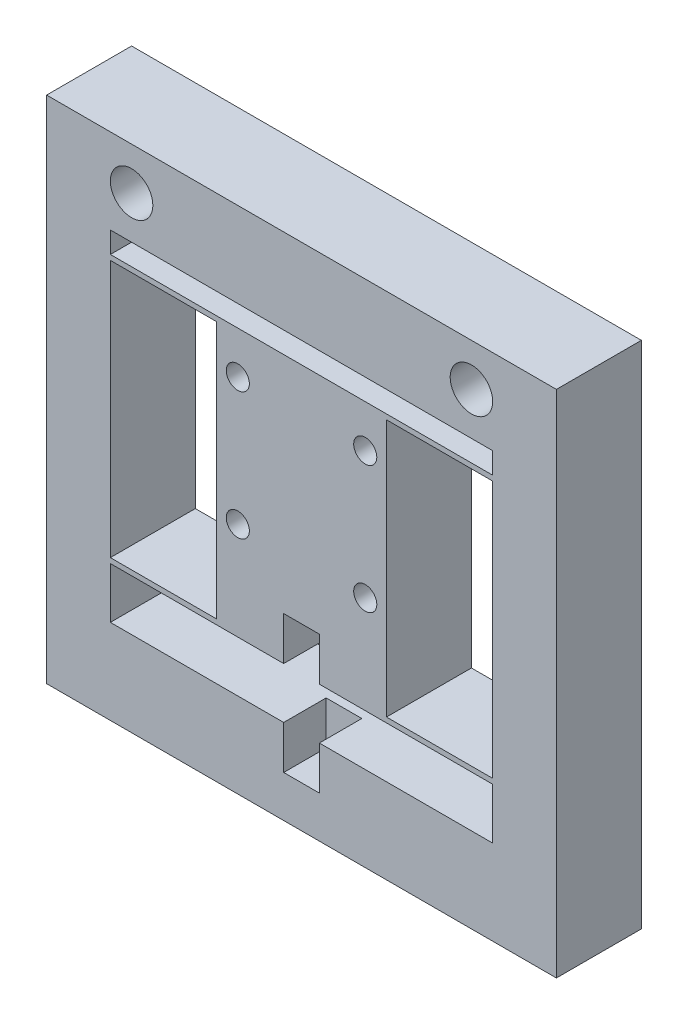
ISO-10303-21;
HEADER;
FILE_DESCRIPTION(('STEP AP214'),'2;1');
FILE_NAME('part.step','',(''),(''),'','','');
FILE_SCHEMA(('AUTOMOTIVE_DESIGN { 1 0 10303 214 1 1 1 1 }'));
ENDSEC;
DATA;
#1=APPLICATION_CONTEXT('core data for automotive mechanical design processes');
#2=APPLICATION_PROTOCOL_DEFINITION('international standard','automotive_design',2000,#1);
#3=PRODUCT_CONTEXT('',#1,'mechanical');
#4=PRODUCT('Part','Part','',(#3));
#5=PRODUCT_RELATED_PRODUCT_CATEGORY('part','',(#4));
#6=PRODUCT_DEFINITION_FORMATION('','',#4);
#7=PRODUCT_DEFINITION_CONTEXT('part definition',#1,'design');
#8=PRODUCT_DEFINITION('design','',#6,#7);
#9=PRODUCT_DEFINITION_SHAPE('','',#8);
#10=(LENGTH_UNIT() NAMED_UNIT(*) SI_UNIT(.MILLI.,.METRE.));
#11=(NAMED_UNIT(*) PLANE_ANGLE_UNIT() SI_UNIT($,.RADIAN.));
#12=(NAMED_UNIT(*) SI_UNIT($,.STERADIAN.) SOLID_ANGLE_UNIT());
#13=UNCERTAINTY_MEASURE_WITH_UNIT(LENGTH_MEASURE(1.E-05),#10,'distance_accuracy_value','');
#14=(GEOMETRIC_REPRESENTATION_CONTEXT(3) GLOBAL_UNCERTAINTY_ASSIGNED_CONTEXT((#13)) GLOBAL_UNIT_ASSIGNED_CONTEXT((#10,
#11,#12)) REPRESENTATION_CONTEXT('',''));
#15=CARTESIAN_POINT('',(0.,0.,0.));
#16=DIRECTION('',(0.,0.,1.));
#17=DIRECTION('',(1.,0.,0.));
#18=AXIS2_PLACEMENT_3D('',#15,#16,#17);
#19=CARTESIAN_POINT('',(-38.1,38.1,6.35));
#20=DIRECTION('',(1.,0.,0.));
#21=DIRECTION('',(0.,1.,0.));
#22=AXIS2_PLACEMENT_3D('',#19,#20,#21);
#23=PLANE('',#22);
#24=DIRECTION('',(0.,-1.,0.));
#25=VECTOR('',#24,1.);
#26=CARTESIAN_POINT('',(-38.1,38.1,-6.35));
#27=LINE('',#26,#25);
#28=CARTESIAN_POINT('',(-38.1,38.1,-6.35));
#29=VERTEX_POINT('',#28);
#30=CARTESIAN_POINT('',(-38.1,-38.1,-6.35));
#31=VERTEX_POINT('',#30);
#32=EDGE_CURVE('E395',#29,#31,#27,.T.);
#33=ORIENTED_EDGE('',*,*,#32,.T.);
#34=DIRECTION('',(0.,0.,-1.));
#35=VECTOR('',#34,1.);
#36=CARTESIAN_POINT('',(-38.1,-38.1,6.35));
#37=LINE('',#36,#35);
#38=CARTESIAN_POINT('',(-38.1,-38.1,6.35));
#39=VERTEX_POINT('',#38);
#40=EDGE_CURVE('E428',#39,#31,#37,.T.);
#41=ORIENTED_EDGE('',*,*,#40,.F.);
#42=DIRECTION('',(0.,-1.,0.));
#43=VECTOR('',#42,1.);
#44=CARTESIAN_POINT('',(-38.1,38.1,6.35));
#45=LINE('',#44,#43);
#46=CARTESIAN_POINT('',(-38.1,38.1,6.35));
#47=VERTEX_POINT('',#46);
#48=EDGE_CURVE('E402',#47,#39,#45,.T.);
#49=ORIENTED_EDGE('',*,*,#48,.F.);
#50=DIRECTION('',(0.,0.,-1.));
#51=VECTOR('',#50,1.);
#52=CARTESIAN_POINT('',(-38.1,38.1,6.35));
#53=LINE('',#52,#51);
#54=EDGE_CURVE('E412',#47,#29,#53,.T.);
#55=ORIENTED_EDGE('',*,*,#54,.T.);
#56=EDGE_LOOP('',(#33,#41,#49,#55));
#57=FACE_BOUND('',#56,.T.);
#58=ADVANCED_FACE('F34',(#57),#23,.F.);
#59=CARTESIAN_POINT('',(-38.1,-38.1,6.35));
#60=DIRECTION('',(0.,1.,0.));
#61=DIRECTION('',(0.,0.,1.));
#62=AXIS2_PLACEMENT_3D('',#59,#60,#61);
#63=PLANE('',#62);
#64=DIRECTION('',(1.,0.,0.));
#65=VECTOR('',#64,1.);
#66=CARTESIAN_POINT('',(-38.1,-38.1,-6.35));
#67=LINE('',#66,#65);
#68=CARTESIAN_POINT('',(38.1,-38.1,-6.35));
#69=VERTEX_POINT('',#68);
#70=EDGE_CURVE('E415',#31,#69,#67,.T.);
#71=ORIENTED_EDGE('',*,*,#70,.T.);
#72=DIRECTION('',(0.,0.,-1.));
#73=VECTOR('',#72,1.);
#74=CARTESIAN_POINT('',(38.1,-38.1,6.35));
#75=LINE('',#74,#73);
#76=CARTESIAN_POINT('',(38.1,-38.1,6.35));
#77=VERTEX_POINT('',#76);
#78=EDGE_CURVE('E425',#77,#69,#75,.T.);
#79=ORIENTED_EDGE('',*,*,#78,.F.);
#80=DIRECTION('',(1.,0.,0.));
#81=VECTOR('',#80,1.);
#82=CARTESIAN_POINT('',(-38.1,-38.1,6.35));
#83=LINE('',#82,#81);
#84=EDGE_CURVE('E405',#39,#77,#83,.T.);
#85=ORIENTED_EDGE('',*,*,#84,.F.);
#86=ORIENTED_EDGE('',*,*,#40,.T.);
#87=EDGE_LOOP('',(#71,#79,#85,#86));
#88=FACE_BOUND('',#87,.T.);
#89=ADVANCED_FACE('F531',(#88),#63,.F.);
#90=CARTESIAN_POINT('',(38.1,38.1,6.35));
#91=DIRECTION('',(-1.,0.,0.));
#92=DIRECTION('',(0.,-1.,0.));
#93=AXIS2_PLACEMENT_3D('',#90,#91,#92);
#94=PLANE('',#93);
#95=DIRECTION('',(0.,1.,0.));
#96=VECTOR('',#95,1.);
#97=CARTESIAN_POINT('',(38.1,38.1,-6.35));
#98=LINE('',#97,#96);
#99=CARTESIAN_POINT('',(38.1,38.1,-6.35));
#100=VERTEX_POINT('',#99);
#101=EDGE_CURVE('E417',#69,#100,#98,.T.);
#102=ORIENTED_EDGE('',*,*,#101,.T.);
#103=DIRECTION('',(0.,0.,-1.));
#104=VECTOR('',#103,1.);
#105=CARTESIAN_POINT('',(38.1,38.1,6.35));
#106=LINE('',#105,#104);
#107=CARTESIAN_POINT('',(38.1,38.1,6.35));
#108=VERTEX_POINT('',#107);
#109=EDGE_CURVE('E422',#108,#100,#106,.T.);
#110=ORIENTED_EDGE('',*,*,#109,.F.);
#111=DIRECTION('',(0.,1.,0.));
#112=VECTOR('',#111,1.);
#113=CARTESIAN_POINT('',(38.1,38.1,6.35));
#114=LINE('',#113,#112);
#115=EDGE_CURVE('E408',#77,#108,#114,.T.);
#116=ORIENTED_EDGE('',*,*,#115,.F.);
#117=ORIENTED_EDGE('',*,*,#78,.T.);
#118=EDGE_LOOP('',(#102,#110,#116,#117));
#119=FACE_BOUND('',#118,.T.);
#120=ADVANCED_FACE('F536',(#119),#94,.F.);
#121=CARTESIAN_POINT('',(-38.1,38.1,6.35));
#122=DIRECTION('',(0.,-1.,0.));
#123=DIRECTION('',(0.,0.,-1.));
#124=AXIS2_PLACEMENT_3D('',#121,#122,#123);
#125=PLANE('',#124);
#126=DIRECTION('',(-1.,0.,0.));
#127=VECTOR('',#126,1.);
#128=CARTESIAN_POINT('',(-38.1,38.1,-6.35));
#129=LINE('',#128,#127);
#130=EDGE_CURVE('E406',#100,#29,#129,.T.);
#131=ORIENTED_EDGE('',*,*,#130,.T.);
#132=ORIENTED_EDGE('',*,*,#54,.F.);
#133=DIRECTION('',(-1.,0.,0.));
#134=VECTOR('',#133,1.);
#135=CARTESIAN_POINT('',(-38.1,38.1,6.35));
#136=LINE('',#135,#134);
#137=EDGE_CURVE('E410',#108,#47,#136,.T.);
#138=ORIENTED_EDGE('',*,*,#137,.F.);
#139=ORIENTED_EDGE('',*,*,#109,.T.);
#140=EDGE_LOOP('',(#131,#132,#138,#139));
#141=FACE_BOUND('',#140,.T.);
#142=ADVANCED_FACE('F501',(#141),#125,.F.);
#143=CARTESIAN_POINT('',(0.,0.,6.35));
#144=DIRECTION('',(0.,0.,1.));
#145=DIRECTION('',(1.,0.,0.));
#146=AXIS2_PLACEMENT_3D('',#143,#144,#145);
#147=PLANE('',#146);
#148=CARTESIAN_POINT('',(-9.525,15.875,6.35));
#149=DIRECTION('',(0.,0.,1.));
#150=DIRECTION('',(1.,0.,0.));
#151=AXIS2_PLACEMENT_3D('',#148,#149,#150);
#152=CIRCLE('',#151,1.72719999999999);
#153=CARTESIAN_POINT('',(-7.79780000000001,15.875,6.35));
#154=VERTEX_POINT('',#153);
#155=EDGE_CURVE('E493',#154,#154,#152,.T.);
#156=ORIENTED_EDGE('',*,*,#155,.F.);
#157=EDGE_LOOP('',(#156));
#158=FACE_BOUND('',#157,.T.);
#159=CARTESIAN_POINT('',(9.525,15.875,6.35));
#160=DIRECTION('',(0.,0.,1.));
#161=DIRECTION('',(1.,0.,0.));
#162=AXIS2_PLACEMENT_3D('',#159,#160,#161);
#163=CIRCLE('',#162,1.72719999999999);
#164=CARTESIAN_POINT('',(11.2522,15.875,6.35));
#165=VERTEX_POINT('',#164);
#166=EDGE_CURVE('E487',#165,#165,#163,.T.);
#167=ORIENTED_EDGE('',*,*,#166,.F.);
#168=EDGE_LOOP('',(#167));
#169=FACE_BOUND('',#168,.T.);
#170=CARTESIAN_POINT('',(9.525,-3.175,6.35));
#171=DIRECTION('',(0.,0.,1.));
#172=DIRECTION('',(1.,0.,0.));
#173=AXIS2_PLACEMENT_3D('',#170,#171,#172);
#174=CIRCLE('',#173,1.72719999999999);
#175=CARTESIAN_POINT('',(11.2522,-3.175,6.35));
#176=VERTEX_POINT('',#175);
#177=EDGE_CURVE('E481',#176,#176,#174,.T.);
#178=ORIENTED_EDGE('',*,*,#177,.F.);
#179=EDGE_LOOP('',(#178));
#180=FACE_BOUND('',#179,.T.);
#181=CARTESIAN_POINT('',(-9.525,-3.175,6.35));
#182=DIRECTION('',(0.,0.,1.));
#183=DIRECTION('',(1.,0.,0.));
#184=AXIS2_PLACEMENT_3D('',#181,#182,#183);
#185=CIRCLE('',#184,1.72719999999999);
#186=CARTESIAN_POINT('',(-7.79780000000001,-3.175,6.35));
#187=VERTEX_POINT('',#186);
#188=EDGE_CURVE('E475',#187,#187,#185,.T.);
#189=ORIENTED_EDGE('',*,*,#188,.F.);
#190=EDGE_LOOP('',(#189));
#191=FACE_BOUND('',#190,.T.);
#192=CARTESIAN_POINT('',(-25.4,31.75,6.35));
#193=DIRECTION('',(0.,0.,1.));
#194=DIRECTION('',(1.,0.,0.));
#195=AXIS2_PLACEMENT_3D('',#192,#193,#194);
#196=CIRCLE('',#195,3.17499999999999);
#197=CARTESIAN_POINT('',(-22.225,31.75,6.35));
#198=VERTEX_POINT('',#197);
#199=EDGE_CURVE('E469',#198,#198,#196,.T.);
#200=ORIENTED_EDGE('',*,*,#199,.F.);
#201=EDGE_LOOP('',(#200));
#202=FACE_BOUND('',#201,.T.);
#203=CARTESIAN_POINT('',(25.4,31.75,6.35));
#204=DIRECTION('',(0.,0.,1.));
#205=DIRECTION('',(1.,0.,0.));
#206=AXIS2_PLACEMENT_3D('',#203,#204,#205);
#207=CIRCLE('',#206,3.17499999999999);
#208=CARTESIAN_POINT('',(28.575,31.75,6.35));
#209=VERTEX_POINT('',#208);
#210=EDGE_CURVE('E460',#209,#209,#207,.T.);
#211=ORIENTED_EDGE('',*,*,#210,.F.);
#212=EDGE_LOOP('',(#211));
#213=FACE_BOUND('',#212,.T.);
#214=DIRECTION('',(0.,-1.,0.));
#215=VECTOR('',#214,1.);
#216=CARTESIAN_POINT('',(-2.667,-11.303,6.35));
#217=LINE('',#216,#215);
#218=CARTESIAN_POINT('',(-2.667,-11.303,6.35));
#219=VERTEX_POINT('',#218);
#220=CARTESIAN_POINT('',(-2.667,-17.78,6.35));
#221=VERTEX_POINT('',#220);
#222=EDGE_CURVE('E246',#219,#221,#217,.T.);
#223=ORIENTED_EDGE('',*,*,#222,.F.);
#224=DIRECTION('',(-1.,0.,0.));
#225=VECTOR('',#224,1.);
#226=CARTESIAN_POINT('',(-2.667,-11.303,6.35));
#227=LINE('',#226,#225);
#228=CARTESIAN_POINT('',(2.667,-11.303,6.35));
#229=VERTEX_POINT('',#228);
#230=EDGE_CURVE('E226',#229,#219,#227,.T.);
#231=ORIENTED_EDGE('',*,*,#230,.F.);
#232=DIRECTION('',(0.,1.,0.));
#233=VECTOR('',#232,1.);
#234=CARTESIAN_POINT('',(2.667,-11.303,6.35));
#235=LINE('',#234,#233);
#236=CARTESIAN_POINT('',(2.667,-17.78,6.35));
#237=VERTEX_POINT('',#236);
#238=EDGE_CURVE('E250',#237,#229,#235,.T.);
#239=ORIENTED_EDGE('',*,*,#238,.F.);
#240=DIRECTION('',(-1.,0.,0.));
#241=VECTOR('',#240,1.);
#242=CARTESIAN_POINT('',(-28.575,-17.78,6.35));
#243=LINE('',#242,#241);
#244=CARTESIAN_POINT('',(28.575,-17.78,6.35));
#245=VERTEX_POINT('',#244);
#246=EDGE_CURVE('E274',#245,#237,#243,.T.);
#247=ORIENTED_EDGE('',*,*,#246,.F.);
#248=DIRECTION('',(0.,1.,0.));
#249=VECTOR('',#248,1.);
#250=CARTESIAN_POINT('',(28.575,-17.78,6.35));
#251=LINE('',#250,#249);
#252=CARTESIAN_POINT('',(28.575,-25.4,6.35));
#253=VERTEX_POINT('',#252);
#254=EDGE_CURVE('E289',#253,#245,#251,.T.);
#255=ORIENTED_EDGE('',*,*,#254,.F.);
#256=DIRECTION('',(1.,0.,0.));
#257=VECTOR('',#256,1.);
#258=CARTESIAN_POINT('',(-28.575,-25.4,6.35));
#259=LINE('',#258,#257);
#260=CARTESIAN_POINT('',(2.667,-25.4,6.35));
#261=VERTEX_POINT('',#260);
#262=EDGE_CURVE('E285',#261,#253,#259,.T.);
#263=ORIENTED_EDGE('',*,*,#262,.F.);
#264=CARTESIAN_POINT('',(2.667,-31.877,6.35));
#265=VERTEX_POINT('',#264);
#266=EDGE_CURVE('E251',#265,#261,#235,.T.);
#267=ORIENTED_EDGE('',*,*,#266,.F.);
#268=DIRECTION('',(1.,0.,0.));
#269=VECTOR('',#268,1.);
#270=CARTESIAN_POINT('',(-2.667,-31.877,6.35));
#271=LINE('',#270,#269);
#272=CARTESIAN_POINT('',(-2.667,-31.877,6.35));
#273=VERTEX_POINT('',#272);
#274=EDGE_CURVE('E248',#273,#265,#271,.T.);
#275=ORIENTED_EDGE('',*,*,#274,.F.);
#276=CARTESIAN_POINT('',(-2.667,-25.4,6.35));
#277=VERTEX_POINT('',#276);
#278=EDGE_CURVE('E232',#277,#273,#217,.T.);
#279=ORIENTED_EDGE('',*,*,#278,.F.);
#280=CARTESIAN_POINT('',(-28.575,-25.4,6.35));
#281=VERTEX_POINT('',#280);
#282=EDGE_CURVE('E286',#281,#277,#259,.T.);
#283=ORIENTED_EDGE('',*,*,#282,.F.);
#284=DIRECTION('',(0.,-1.,0.));
#285=VECTOR('',#284,1.);
#286=CARTESIAN_POINT('',(-28.575,-17.78,6.35));
#287=LINE('',#286,#285);
#288=CARTESIAN_POINT('',(-28.575,-17.78,6.35));
#289=VERTEX_POINT('',#288);
#290=EDGE_CURVE('E269',#289,#281,#287,.T.);
#291=ORIENTED_EDGE('',*,*,#290,.F.);
#292=EDGE_CURVE('E292',#221,#289,#243,.T.);
#293=ORIENTED_EDGE('',*,*,#292,.F.);
#294=EDGE_LOOP('',(#223,#231,#239,#247,#255,#263,#267,#275,#279,#283,#291,#293));
#295=FACE_BOUND('',#294,.T.);
#296=DIRECTION('',(0.,-1.,0.));
#297=VECTOR('',#296,1.);
#298=CARTESIAN_POINT('',(-28.575,21.463,6.35));
#299=LINE('',#298,#297);
#300=CARTESIAN_POINT('',(-28.575,21.463,6.35));
#301=VERTEX_POINT('',#300);
#302=CARTESIAN_POINT('',(-28.575,-17.018,6.35));
#303=VERTEX_POINT('',#302);
#304=EDGE_CURVE('E298',#301,#303,#299,.T.);
#305=ORIENTED_EDGE('',*,*,#304,.F.);
#306=DIRECTION('',(-1.,0.,0.));
#307=VECTOR('',#306,1.);
#308=CARTESIAN_POINT('',(-28.575,21.463,6.35));
#309=LINE('',#308,#307);
#310=CARTESIAN_POINT('',(-12.7,21.463,6.35));
#311=VERTEX_POINT('',#310);
#312=EDGE_CURVE('E310',#311,#301,#309,.T.);
#313=ORIENTED_EDGE('',*,*,#312,.F.);
#314=DIRECTION('',(0.,1.,0.));
#315=VECTOR('',#314,1.);
#316=CARTESIAN_POINT('',(-12.7,21.463,6.35));
#317=LINE('',#316,#315);
#318=CARTESIAN_POINT('',(-12.7,-17.018,6.35));
#319=VERTEX_POINT('',#318);
#320=EDGE_CURVE('E324',#319,#311,#317,.T.);
#321=ORIENTED_EDGE('',*,*,#320,.F.);
#322=DIRECTION('',(1.,0.,0.));
#323=VECTOR('',#322,1.);
#324=CARTESIAN_POINT('',(-28.575,-17.018,6.35));
#325=LINE('',#324,#323);
#326=EDGE_CURVE('E321',#303,#319,#325,.T.);
#327=ORIENTED_EDGE('',*,*,#326,.F.);
#328=EDGE_LOOP('',(#305,#313,#321,#327));
#329=FACE_BOUND('',#328,.T.);
#330=DIRECTION('',(0.,-1.,0.));
#331=VECTOR('',#330,1.);
#332=CARTESIAN_POINT('',(12.7,21.463,6.35));
#333=LINE('',#332,#331);
#334=CARTESIAN_POINT('',(12.7,21.463,6.35));
#335=VERTEX_POINT('',#334);
#336=CARTESIAN_POINT('',(12.7,-17.018,6.35));
#337=VERTEX_POINT('',#336);
#338=EDGE_CURVE('E331',#335,#337,#333,.T.);
#339=ORIENTED_EDGE('',*,*,#338,.F.);
#340=DIRECTION('',(-1.,0.,0.));
#341=VECTOR('',#340,1.);
#342=CARTESIAN_POINT('',(12.7,21.463,6.35));
#343=LINE('',#342,#341);
#344=CARTESIAN_POINT('',(28.575,21.463,6.35));
#345=VERTEX_POINT('',#344);
#346=EDGE_CURVE('E342',#345,#335,#343,.T.);
#347=ORIENTED_EDGE('',*,*,#346,.F.);
#348=DIRECTION('',(0.,1.,0.));
#349=VECTOR('',#348,1.);
#350=CARTESIAN_POINT('',(28.575,21.463,6.35));
#351=LINE('',#350,#349);
#352=CARTESIAN_POINT('',(28.575,-17.018,6.35));
#353=VERTEX_POINT('',#352);
#354=EDGE_CURVE('E356',#353,#345,#351,.T.);
#355=ORIENTED_EDGE('',*,*,#354,.F.);
#356=DIRECTION('',(1.,0.,0.));
#357=VECTOR('',#356,1.);
#358=CARTESIAN_POINT('',(12.7,-17.018,6.35));
#359=LINE('',#358,#357);
#360=EDGE_CURVE('E353',#337,#353,#359,.T.);
#361=ORIENTED_EDGE('',*,*,#360,.F.);
#362=EDGE_LOOP('',(#339,#347,#355,#361));
#363=FACE_BOUND('',#362,.T.);
#364=DIRECTION('',(0.,-1.,0.));
#365=VECTOR('',#364,1.);
#366=CARTESIAN_POINT('',(-28.575,25.4,6.35));
#367=LINE('',#366,#365);
#368=CARTESIAN_POINT('',(-28.575,25.4,6.35));
#369=VERTEX_POINT('',#368);
#370=CARTESIAN_POINT('',(-28.575,22.225,6.35));
#371=VERTEX_POINT('',#370);
#372=EDGE_CURVE('E363',#369,#371,#367,.T.);
#373=ORIENTED_EDGE('',*,*,#372,.F.);
#374=DIRECTION('',(-1.,0.,0.));
#375=VECTOR('',#374,1.);
#376=CARTESIAN_POINT('',(-28.575,25.4,6.35));
#377=LINE('',#376,#375);
#378=CARTESIAN_POINT('',(28.575,25.4,6.35));
#379=VERTEX_POINT('',#378);
#380=EDGE_CURVE('E374',#379,#369,#377,.T.);
#381=ORIENTED_EDGE('',*,*,#380,.F.);
#382=DIRECTION('',(0.,1.,0.));
#383=VECTOR('',#382,1.);
#384=CARTESIAN_POINT('',(28.575,25.4,6.35));
#385=LINE('',#384,#383);
#386=CARTESIAN_POINT('',(28.575,22.225,6.35));
#387=VERTEX_POINT('',#386);
#388=EDGE_CURVE('E388',#387,#379,#385,.T.);
#389=ORIENTED_EDGE('',*,*,#388,.F.);
#390=DIRECTION('',(1.,0.,0.));
#391=VECTOR('',#390,1.);
#392=CARTESIAN_POINT('',(-28.575,22.225,6.35));
#393=LINE('',#392,#391);
#394=EDGE_CURVE('E385',#371,#387,#393,.T.);
#395=ORIENTED_EDGE('',*,*,#394,.F.);
#396=EDGE_LOOP('',(#373,#381,#389,#395));
#397=FACE_BOUND('',#396,.T.);
#398=ORIENTED_EDGE('',*,*,#48,.T.);
#399=ORIENTED_EDGE('',*,*,#84,.T.);
#400=ORIENTED_EDGE('',*,*,#115,.T.);
#401=ORIENTED_EDGE('',*,*,#137,.T.);
#402=EDGE_LOOP('',(#398,#399,#400,#401));
#403=FACE_BOUND('',#402,.T.);
#404=ADVANCED_FACE('F441',(#158,#169,#180,#191,#202,#213,#295,#329,#363,#397,#403),#147,.T.);
#405=CARTESIAN_POINT('',(0.,0.,-6.35));
#406=DIRECTION('',(0.,0.,1.));
#407=DIRECTION('',(1.,0.,0.));
#408=AXIS2_PLACEMENT_3D('',#405,#406,#407);
#409=PLANE('',#408);
#410=CARTESIAN_POINT('',(-9.525,15.875,-6.35));
#411=DIRECTION('',(0.,0.,1.));
#412=DIRECTION('',(1.,0.,0.));
#413=AXIS2_PLACEMENT_3D('',#410,#411,#412);
#414=CIRCLE('',#413,1.72719999999999);
#415=CARTESIAN_POINT('',(-7.79780000000001,15.875,-6.35));
#416=VERTEX_POINT('',#415);
#417=EDGE_CURVE('E490',#416,#416,#414,.T.);
#418=ORIENTED_EDGE('',*,*,#417,.T.);
#419=EDGE_LOOP('',(#418));
#420=FACE_BOUND('',#419,.T.);
#421=CARTESIAN_POINT('',(9.525,15.875,-6.35));
#422=DIRECTION('',(0.,0.,1.));
#423=DIRECTION('',(1.,0.,0.));
#424=AXIS2_PLACEMENT_3D('',#421,#422,#423);
#425=CIRCLE('',#424,1.72719999999999);
#426=CARTESIAN_POINT('',(11.2522,15.875,-6.35));
#427=VERTEX_POINT('',#426);
#428=EDGE_CURVE('E484',#427,#427,#425,.T.);
#429=ORIENTED_EDGE('',*,*,#428,.T.);
#430=EDGE_LOOP('',(#429));
#431=FACE_BOUND('',#430,.T.);
#432=CARTESIAN_POINT('',(9.525,-3.175,-6.35));
#433=DIRECTION('',(0.,0.,1.));
#434=DIRECTION('',(1.,0.,0.));
#435=AXIS2_PLACEMENT_3D('',#432,#433,#434);
#436=CIRCLE('',#435,1.72719999999999);
#437=CARTESIAN_POINT('',(11.2522,-3.175,-6.35));
#438=VERTEX_POINT('',#437);
#439=EDGE_CURVE('E478',#438,#438,#436,.T.);
#440=ORIENTED_EDGE('',*,*,#439,.T.);
#441=EDGE_LOOP('',(#440));
#442=FACE_BOUND('',#441,.T.);
#443=CARTESIAN_POINT('',(-9.525,-3.175,-6.35));
#444=DIRECTION('',(0.,0.,1.));
#445=DIRECTION('',(1.,0.,0.));
#446=AXIS2_PLACEMENT_3D('',#443,#444,#445);
#447=CIRCLE('',#446,1.72719999999999);
#448=CARTESIAN_POINT('',(-7.79780000000001,-3.175,-6.35));
#449=VERTEX_POINT('',#448);
#450=EDGE_CURVE('E472',#449,#449,#447,.T.);
#451=ORIENTED_EDGE('',*,*,#450,.T.);
#452=EDGE_LOOP('',(#451));
#453=FACE_BOUND('',#452,.T.);
#454=CARTESIAN_POINT('',(-25.4,31.75,-6.35));
#455=DIRECTION('',(0.,0.,1.));
#456=DIRECTION('',(1.,0.,0.));
#457=AXIS2_PLACEMENT_3D('',#454,#455,#456);
#458=CIRCLE('',#457,3.17499999999999);
#459=CARTESIAN_POINT('',(-22.225,31.75,-6.35));
#460=VERTEX_POINT('',#459);
#461=EDGE_CURVE('E464',#460,#460,#458,.T.);
#462=ORIENTED_EDGE('',*,*,#461,.T.);
#463=EDGE_LOOP('',(#462));
#464=FACE_BOUND('',#463,.T.);
#465=CARTESIAN_POINT('',(25.4,31.75,-6.35));
#466=DIRECTION('',(0.,0.,1.));
#467=DIRECTION('',(1.,0.,0.));
#468=AXIS2_PLACEMENT_3D('',#465,#466,#467);
#469=CIRCLE('',#468,3.17499999999999);
#470=CARTESIAN_POINT('',(28.575,31.75,-6.35));
#471=VERTEX_POINT('',#470);
#472=EDGE_CURVE('E458',#471,#471,#469,.T.);
#473=ORIENTED_EDGE('',*,*,#472,.T.);
#474=EDGE_LOOP('',(#473));
#475=FACE_BOUND('',#474,.T.);
#476=DIRECTION('',(-1.,0.,0.));
#477=VECTOR('',#476,1.);
#478=CARTESIAN_POINT('',(-28.575,-17.78,-6.35));
#479=LINE('',#478,#477);
#480=CARTESIAN_POINT('',(28.575,-17.78,-6.35));
#481=VERTEX_POINT('',#480);
#482=CARTESIAN_POINT('',(-28.575,-17.78,-6.35));
#483=VERTEX_POINT('',#482);
#484=EDGE_CURVE('E280',#481,#483,#479,.T.);
#485=ORIENTED_EDGE('',*,*,#484,.T.);
#486=DIRECTION('',(0.,-1.,0.));
#487=VECTOR('',#486,1.);
#488=CARTESIAN_POINT('',(-28.575,-17.78,-6.35));
#489=LINE('',#488,#487);
#490=CARTESIAN_POINT('',(-28.575,-25.4,-6.35));
#491=VERTEX_POINT('',#490);
#492=EDGE_CURVE('E270',#483,#491,#489,.T.);
#493=ORIENTED_EDGE('',*,*,#492,.T.);
#494=DIRECTION('',(1.,0.,0.));
#495=VECTOR('',#494,1.);
#496=CARTESIAN_POINT('',(-28.575,-25.4,-6.35));
#497=LINE('',#496,#495);
#498=CARTESIAN_POINT('',(28.575,-25.4,-6.35));
#499=VERTEX_POINT('',#498);
#500=EDGE_CURVE('E273',#491,#499,#497,.T.);
#501=ORIENTED_EDGE('',*,*,#500,.T.);
#502=DIRECTION('',(0.,1.,0.));
#503=VECTOR('',#502,1.);
#504=CARTESIAN_POINT('',(28.575,-17.78,-6.35));
#505=LINE('',#504,#503);
#506=EDGE_CURVE('E277',#499,#481,#505,.T.);
#507=ORIENTED_EDGE('',*,*,#506,.T.);
#508=EDGE_LOOP('',(#485,#493,#501,#507));
#509=FACE_BOUND('',#508,.T.);
#510=DIRECTION('',(-1.,0.,0.));
#511=VECTOR('',#510,1.);
#512=CARTESIAN_POINT('',(-28.575,21.463,-6.35));
#513=LINE('',#512,#511);
#514=CARTESIAN_POINT('',(-12.7,21.463,-6.35));
#515=VERTEX_POINT('',#514);
#516=CARTESIAN_POINT('',(-28.575,21.463,-6.35));
#517=VERTEX_POINT('',#516);
#518=EDGE_CURVE('E316',#515,#517,#513,.T.);
#519=ORIENTED_EDGE('',*,*,#518,.T.);
#520=DIRECTION('',(0.,-1.,0.));
#521=VECTOR('',#520,1.);
#522=CARTESIAN_POINT('',(-28.575,21.463,-6.35));
#523=LINE('',#522,#521);
#524=CARTESIAN_POINT('',(-28.575,-17.018,-6.35));
#525=VERTEX_POINT('',#524);
#526=EDGE_CURVE('E306',#517,#525,#523,.T.);
#527=ORIENTED_EDGE('',*,*,#526,.T.);
#528=DIRECTION('',(1.,0.,0.));
#529=VECTOR('',#528,1.);
#530=CARTESIAN_POINT('',(-28.575,-17.018,-6.35));
#531=LINE('',#530,#529);
#532=CARTESIAN_POINT('',(-12.7,-17.018,-6.35));
#533=VERTEX_POINT('',#532);
#534=EDGE_CURVE('E309',#525,#533,#531,.T.);
#535=ORIENTED_EDGE('',*,*,#534,.T.);
#536=DIRECTION('',(0.,1.,0.));
#537=VECTOR('',#536,1.);
#538=CARTESIAN_POINT('',(-12.7,21.463,-6.35));
#539=LINE('',#538,#537);
#540=EDGE_CURVE('E313',#533,#515,#539,.T.);
#541=ORIENTED_EDGE('',*,*,#540,.T.);
#542=EDGE_LOOP('',(#519,#527,#535,#541));
#543=FACE_BOUND('',#542,.T.);
#544=DIRECTION('',(-1.,0.,0.));
#545=VECTOR('',#544,1.);
#546=CARTESIAN_POINT('',(12.7,21.463,-6.35));
#547=LINE('',#546,#545);
#548=CARTESIAN_POINT('',(28.575,21.463,-6.35));
#549=VERTEX_POINT('',#548);
#550=CARTESIAN_POINT('',(12.7,21.463,-6.35));
#551=VERTEX_POINT('',#550);
#552=EDGE_CURVE('E348',#549,#551,#547,.T.);
#553=ORIENTED_EDGE('',*,*,#552,.T.);
#554=DIRECTION('',(0.,-1.,0.));
#555=VECTOR('',#554,1.);
#556=CARTESIAN_POINT('',(12.7,21.463,-6.35));
#557=LINE('',#556,#555);
#558=CARTESIAN_POINT('',(12.7,-17.018,-6.35));
#559=VERTEX_POINT('',#558);
#560=EDGE_CURVE('E338',#551,#559,#557,.T.);
#561=ORIENTED_EDGE('',*,*,#560,.T.);
#562=DIRECTION('',(1.,0.,0.));
#563=VECTOR('',#562,1.);
#564=CARTESIAN_POINT('',(12.7,-17.018,-6.35));
#565=LINE('',#564,#563);
#566=CARTESIAN_POINT('',(28.575,-17.018,-6.35));
#567=VERTEX_POINT('',#566);
#568=EDGE_CURVE('E341',#559,#567,#565,.T.);
#569=ORIENTED_EDGE('',*,*,#568,.T.);
#570=DIRECTION('',(0.,1.,0.));
#571=VECTOR('',#570,1.);
#572=CARTESIAN_POINT('',(28.575,21.463,-6.35));
#573=LINE('',#572,#571);
#574=EDGE_CURVE('E345',#567,#549,#573,.T.);
#575=ORIENTED_EDGE('',*,*,#574,.T.);
#576=EDGE_LOOP('',(#553,#561,#569,#575));
#577=FACE_BOUND('',#576,.T.);
#578=DIRECTION('',(-1.,0.,0.));
#579=VECTOR('',#578,1.);
#580=CARTESIAN_POINT('',(-28.575,25.4,-6.35));
#581=LINE('',#580,#579);
#582=CARTESIAN_POINT('',(28.575,25.4,-6.35));
#583=VERTEX_POINT('',#582);
#584=CARTESIAN_POINT('',(-28.575,25.4,-6.35));
#585=VERTEX_POINT('',#584);
#586=EDGE_CURVE('E380',#583,#585,#581,.T.);
#587=ORIENTED_EDGE('',*,*,#586,.T.);
#588=DIRECTION('',(0.,-1.,0.));
#589=VECTOR('',#588,1.);
#590=CARTESIAN_POINT('',(-28.575,25.4,-6.35));
#591=LINE('',#590,#589);
#592=CARTESIAN_POINT('',(-28.575,22.225,-6.35));
#593=VERTEX_POINT('',#592);
#594=EDGE_CURVE('E370',#585,#593,#591,.T.);
#595=ORIENTED_EDGE('',*,*,#594,.T.);
#596=DIRECTION('',(1.,0.,0.));
#597=VECTOR('',#596,1.);
#598=CARTESIAN_POINT('',(-28.575,22.225,-6.35));
#599=LINE('',#598,#597);
#600=CARTESIAN_POINT('',(28.575,22.225,-6.35));
#601=VERTEX_POINT('',#600);
#602=EDGE_CURVE('E373',#593,#601,#599,.T.);
#603=ORIENTED_EDGE('',*,*,#602,.T.);
#604=DIRECTION('',(0.,1.,0.));
#605=VECTOR('',#604,1.);
#606=CARTESIAN_POINT('',(28.575,25.4,-6.35));
#607=LINE('',#606,#605);
#608=EDGE_CURVE('E377',#601,#583,#607,.T.);
#609=ORIENTED_EDGE('',*,*,#608,.T.);
#610=EDGE_LOOP('',(#587,#595,#603,#609));
#611=FACE_BOUND('',#610,.T.);
#612=ORIENTED_EDGE('',*,*,#32,.F.);
#613=ORIENTED_EDGE('',*,*,#130,.F.);
#614=ORIENTED_EDGE('',*,*,#101,.F.);
#615=ORIENTED_EDGE('',*,*,#70,.F.);
#616=EDGE_LOOP('',(#612,#613,#614,#615));
#617=FACE_BOUND('',#616,.T.);
#618=ADVANCED_FACE('F450',(#420,#431,#442,#453,#464,#475,#509,#543,#577,#611,#617),#409,.F.);
#619=CARTESIAN_POINT('',(-28.575,25.4,-6.35));
#620=DIRECTION('',(-1.,0.,0.));
#621=DIRECTION('',(0.,0.,1.));
#622=AXIS2_PLACEMENT_3D('',#619,#620,#621);
#623=PLANE('',#622);
#624=ORIENTED_EDGE('',*,*,#372,.T.);
#625=DIRECTION('',(0.,0.,1.));
#626=VECTOR('',#625,1.);
#627=CARTESIAN_POINT('',(-28.575,22.225,-6.35));
#628=LINE('',#627,#626);
#629=EDGE_CURVE('E383',#593,#371,#628,.T.);
#630=ORIENTED_EDGE('',*,*,#629,.F.);
#631=ORIENTED_EDGE('',*,*,#594,.F.);
#632=DIRECTION('',(0.,0.,1.));
#633=VECTOR('',#632,1.);
#634=CARTESIAN_POINT('',(-28.575,25.4,-6.35));
#635=LINE('',#634,#633);
#636=EDGE_CURVE('E393',#585,#369,#635,.T.);
#637=ORIENTED_EDGE('',*,*,#636,.T.);
#638=EDGE_LOOP('',(#624,#630,#631,#637));
#639=FACE_BOUND('',#638,.T.);
#640=ADVANCED_FACE('F560',(#639),#623,.F.);
#641=CARTESIAN_POINT('',(-28.575,25.4,-6.35));
#642=DIRECTION('',(0.,1.,0.));
#643=DIRECTION('',(0.,0.,1.));
#644=AXIS2_PLACEMENT_3D('',#641,#642,#643);
#645=PLANE('',#644);
#646=ORIENTED_EDGE('',*,*,#380,.T.);
#647=ORIENTED_EDGE('',*,*,#636,.F.);
#648=ORIENTED_EDGE('',*,*,#586,.F.);
#649=DIRECTION('',(0.,0.,1.));
#650=VECTOR('',#649,1.);
#651=CARTESIAN_POINT('',(28.575,25.4,-6.35));
#652=LINE('',#651,#650);
#653=EDGE_CURVE('E396',#583,#379,#652,.T.);
#654=ORIENTED_EDGE('',*,*,#653,.T.);
#655=EDGE_LOOP('',(#646,#647,#648,#654));
#656=FACE_BOUND('',#655,.T.);
#657=ADVANCED_FACE('F565',(#656),#645,.F.);
#658=CARTESIAN_POINT('',(28.575,25.4,-6.35));
#659=DIRECTION('',(1.,0.,0.));
#660=DIRECTION('',(0.,0.,-1.));
#661=AXIS2_PLACEMENT_3D('',#658,#659,#660);
#662=PLANE('',#661);
#663=ORIENTED_EDGE('',*,*,#388,.T.);
#664=ORIENTED_EDGE('',*,*,#653,.F.);
#665=ORIENTED_EDGE('',*,*,#608,.F.);
#666=DIRECTION('',(0.,0.,1.));
#667=VECTOR('',#666,1.);
#668=CARTESIAN_POINT('',(28.575,22.225,-6.35));
#669=LINE('',#668,#667);
#670=EDGE_CURVE('E398',#601,#387,#669,.T.);
#671=ORIENTED_EDGE('',*,*,#670,.T.);
#672=EDGE_LOOP('',(#663,#664,#665,#671));
#673=FACE_BOUND('',#672,.T.);
#674=ADVANCED_FACE('F571',(#673),#662,.F.);
#675=CARTESIAN_POINT('',(-28.575,22.225,-6.35));
#676=DIRECTION('',(0.,-1.,0.));
#677=DIRECTION('',(0.,0.,-1.));
#678=AXIS2_PLACEMENT_3D('',#675,#676,#677);
#679=PLANE('',#678);
#680=ORIENTED_EDGE('',*,*,#394,.T.);
#681=ORIENTED_EDGE('',*,*,#670,.F.);
#682=ORIENTED_EDGE('',*,*,#602,.F.);
#683=ORIENTED_EDGE('',*,*,#629,.T.);
#684=EDGE_LOOP('',(#680,#681,#682,#683));
#685=FACE_BOUND('',#684,.T.);
#686=ADVANCED_FACE('F567',(#685),#679,.F.);
#687=CARTESIAN_POINT('',(12.7,21.463,-6.35));
#688=DIRECTION('',(-1.,0.,0.));
#689=DIRECTION('',(0.,-1.,0.));
#690=AXIS2_PLACEMENT_3D('',#687,#688,#689);
#691=PLANE('',#690);
#692=ORIENTED_EDGE('',*,*,#338,.T.);
#693=DIRECTION('',(0.,0.,1.));
#694=VECTOR('',#693,1.);
#695=CARTESIAN_POINT('',(12.7,-17.018,-6.35));
#696=LINE('',#695,#694);
#697=EDGE_CURVE('E351',#559,#337,#696,.T.);
#698=ORIENTED_EDGE('',*,*,#697,.F.);
#699=ORIENTED_EDGE('',*,*,#560,.F.);
#700=DIRECTION('',(0.,0.,1.));
#701=VECTOR('',#700,1.);
#702=CARTESIAN_POINT('',(12.7,21.463,-6.35));
#703=LINE('',#702,#701);
#704=EDGE_CURVE('E361',#551,#335,#703,.T.);
#705=ORIENTED_EDGE('',*,*,#704,.T.);
#706=EDGE_LOOP('',(#692,#698,#699,#705));
#707=FACE_BOUND('',#706,.T.);
#708=ADVANCED_FACE('F570',(#707),#691,.F.);
#709=CARTESIAN_POINT('',(12.7,21.463,-6.35));
#710=DIRECTION('',(0.,1.,0.));
#711=DIRECTION('',(0.,0.,1.));
#712=AXIS2_PLACEMENT_3D('',#709,#710,#711);
#713=PLANE('',#712);
#714=ORIENTED_EDGE('',*,*,#346,.T.);
#715=ORIENTED_EDGE('',*,*,#704,.F.);
#716=ORIENTED_EDGE('',*,*,#552,.F.);
#717=DIRECTION('',(0.,0.,1.));
#718=VECTOR('',#717,1.);
#719=CARTESIAN_POINT('',(28.575,21.463,-6.35));
#720=LINE('',#719,#718);
#721=EDGE_CURVE('E364',#549,#345,#720,.T.);
#722=ORIENTED_EDGE('',*,*,#721,.T.);
#723=EDGE_LOOP('',(#714,#715,#716,#722));
#724=FACE_BOUND('',#723,.T.);
#725=ADVANCED_FACE('F581',(#724),#713,.F.);
#726=CARTESIAN_POINT('',(28.575,21.463,-6.35));
#727=DIRECTION('',(1.,0.,0.));
#728=DIRECTION('',(0.,1.,0.));
#729=AXIS2_PLACEMENT_3D('',#726,#727,#728);
#730=PLANE('',#729);
#731=ORIENTED_EDGE('',*,*,#354,.T.);
#732=ORIENTED_EDGE('',*,*,#721,.F.);
#733=ORIENTED_EDGE('',*,*,#574,.F.);
#734=DIRECTION('',(0.,0.,1.));
#735=VECTOR('',#734,1.);
#736=CARTESIAN_POINT('',(28.575,-17.018,-6.35));
#737=LINE('',#736,#735);
#738=EDGE_CURVE('E366',#567,#353,#737,.T.);
#739=ORIENTED_EDGE('',*,*,#738,.T.);
#740=EDGE_LOOP('',(#731,#732,#733,#739));
#741=FACE_BOUND('',#740,.T.);
#742=ADVANCED_FACE('F587',(#741),#730,.F.);
#743=CARTESIAN_POINT('',(12.7,-17.018,-6.35));
#744=DIRECTION('',(0.,-1.,0.));
#745=DIRECTION('',(0.,0.,-1.));
#746=AXIS2_PLACEMENT_3D('',#743,#744,#745);
#747=PLANE('',#746);
#748=ORIENTED_EDGE('',*,*,#360,.T.);
#749=ORIENTED_EDGE('',*,*,#738,.F.);
#750=ORIENTED_EDGE('',*,*,#568,.F.);
#751=ORIENTED_EDGE('',*,*,#697,.T.);
#752=EDGE_LOOP('',(#748,#749,#750,#751));
#753=FACE_BOUND('',#752,.T.);
#754=ADVANCED_FACE('F583',(#753),#747,.F.);
#755=CARTESIAN_POINT('',(-28.575,21.463,-6.35));
#756=DIRECTION('',(-1.,0.,0.));
#757=DIRECTION('',(0.,-1.,0.));
#758=AXIS2_PLACEMENT_3D('',#755,#756,#757);
#759=PLANE('',#758);
#760=ORIENTED_EDGE('',*,*,#304,.T.);
#761=DIRECTION('',(0.,0.,1.));
#762=VECTOR('',#761,1.);
#763=CARTESIAN_POINT('',(-28.575,-17.018,-6.35));
#764=LINE('',#763,#762);
#765=EDGE_CURVE('E319',#525,#303,#764,.T.);
#766=ORIENTED_EDGE('',*,*,#765,.F.);
#767=ORIENTED_EDGE('',*,*,#526,.F.);
#768=DIRECTION('',(0.,0.,1.));
#769=VECTOR('',#768,1.);
#770=CARTESIAN_POINT('',(-28.575,21.463,-6.35));
#771=LINE('',#770,#769);
#772=EDGE_CURVE('E329',#517,#301,#771,.T.);
#773=ORIENTED_EDGE('',*,*,#772,.T.);
#774=EDGE_LOOP('',(#760,#766,#767,#773));
#775=FACE_BOUND('',#774,.T.);
#776=ADVANCED_FACE('F586',(#775),#759,.F.);
#777=CARTESIAN_POINT('',(-28.575,21.463,-6.35));
#778=DIRECTION('',(0.,1.,0.));
#779=DIRECTION('',(0.,0.,1.));
#780=AXIS2_PLACEMENT_3D('',#777,#778,#779);
#781=PLANE('',#780);
#782=ORIENTED_EDGE('',*,*,#312,.T.);
#783=ORIENTED_EDGE('',*,*,#772,.F.);
#784=ORIENTED_EDGE('',*,*,#518,.F.);
#785=DIRECTION('',(0.,0.,1.));
#786=VECTOR('',#785,1.);
#787=CARTESIAN_POINT('',(-12.7,21.463,-6.35));
#788=LINE('',#787,#786);
#789=EDGE_CURVE('E332',#515,#311,#788,.T.);
#790=ORIENTED_EDGE('',*,*,#789,.T.);
#791=EDGE_LOOP('',(#782,#783,#784,#790));
#792=FACE_BOUND('',#791,.T.);
#793=ADVANCED_FACE('F597',(#792),#781,.F.);
#794=CARTESIAN_POINT('',(-12.7,21.463,-6.35));
#795=DIRECTION('',(1.,0.,0.));
#796=DIRECTION('',(0.,1.,0.));
#797=AXIS2_PLACEMENT_3D('',#794,#795,#796);
#798=PLANE('',#797);
#799=ORIENTED_EDGE('',*,*,#320,.T.);
#800=ORIENTED_EDGE('',*,*,#789,.F.);
#801=ORIENTED_EDGE('',*,*,#540,.F.);
#802=DIRECTION('',(0.,0.,1.));
#803=VECTOR('',#802,1.);
#804=CARTESIAN_POINT('',(-12.7,-17.018,-6.35));
#805=LINE('',#804,#803);
#806=EDGE_CURVE('E334',#533,#319,#805,.T.);
#807=ORIENTED_EDGE('',*,*,#806,.T.);
#808=EDGE_LOOP('',(#799,#800,#801,#807));
#809=FACE_BOUND('',#808,.T.);
#810=ADVANCED_FACE('F602',(#809),#798,.F.);
#811=CARTESIAN_POINT('',(-28.575,-17.018,-6.35));
#812=DIRECTION('',(0.,-1.,0.));
#813=DIRECTION('',(0.,0.,-1.));
#814=AXIS2_PLACEMENT_3D('',#811,#812,#813);
#815=PLANE('',#814);
#816=ORIENTED_EDGE('',*,*,#326,.T.);
#817=ORIENTED_EDGE('',*,*,#806,.F.);
#818=ORIENTED_EDGE('',*,*,#534,.F.);
#819=ORIENTED_EDGE('',*,*,#765,.T.);
#820=EDGE_LOOP('',(#816,#817,#818,#819));
#821=FACE_BOUND('',#820,.T.);
#822=ADVANCED_FACE('F599',(#821),#815,.F.);
#823=CARTESIAN_POINT('',(-28.575,-17.78,-6.35));
#824=DIRECTION('',(-1.,0.,0.));
#825=DIRECTION('',(0.,0.,1.));
#826=AXIS2_PLACEMENT_3D('',#823,#824,#825);
#827=PLANE('',#826);
#828=ORIENTED_EDGE('',*,*,#290,.T.);
#829=DIRECTION('',(0.,0.,1.));
#830=VECTOR('',#829,1.);
#831=CARTESIAN_POINT('',(-28.575,-25.4,-6.35));
#832=LINE('',#831,#830);
#833=EDGE_CURVE('E283',#491,#281,#832,.T.);
#834=ORIENTED_EDGE('',*,*,#833,.F.);
#835=ORIENTED_EDGE('',*,*,#492,.F.);
#836=DIRECTION('',(0.,0.,1.));
#837=VECTOR('',#836,1.);
#838=CARTESIAN_POINT('',(-28.575,-17.78,-6.35));
#839=LINE('',#838,#837);
#840=EDGE_CURVE('E295',#483,#289,#839,.T.);
#841=ORIENTED_EDGE('',*,*,#840,.T.);
#842=EDGE_LOOP('',(#828,#834,#835,#841));
#843=FACE_BOUND('',#842,.T.);
#844=ADVANCED_FACE('F454',(#843),#827,.F.);
#845=CARTESIAN_POINT('',(-28.575,-17.78,-6.35));
#846=DIRECTION('',(0.,1.,0.));
#847=DIRECTION('',(0.,0.,1.));
#848=AXIS2_PLACEMENT_3D('',#845,#846,#847);
#849=PLANE('',#848);
#850=DIRECTION('',(1.,0.,0.));
#851=VECTOR('',#850,1.);
#852=CARTESIAN_POINT('',(-28.575,-17.78,0.));
#853=LINE('',#852,#851);
#854=CARTESIAN_POINT('',(-2.667,-17.78,0.));
#855=VERTEX_POINT('',#854);
#856=CARTESIAN_POINT('',(2.667,-17.78,0.));
#857=VERTEX_POINT('',#856);
#858=EDGE_CURVE('E257',#855,#857,#853,.T.);
#859=ORIENTED_EDGE('',*,*,#858,.F.);
#860=DIRECTION('',(0.,0.,1.));
#861=VECTOR('',#860,1.);
#862=CARTESIAN_POINT('',(-2.667,-17.78,-6.35));
#863=LINE('',#862,#861);
#864=EDGE_CURVE('E266',#855,#221,#863,.T.);
#865=ORIENTED_EDGE('',*,*,#864,.T.);
#866=ORIENTED_EDGE('',*,*,#292,.T.);
#867=ORIENTED_EDGE('',*,*,#840,.F.);
#868=ORIENTED_EDGE('',*,*,#484,.F.);
#869=DIRECTION('',(0.,0.,1.));
#870=VECTOR('',#869,1.);
#871=CARTESIAN_POINT('',(28.575,-17.78,-6.35));
#872=LINE('',#871,#870);
#873=EDGE_CURVE('E299',#481,#245,#872,.T.);
#874=ORIENTED_EDGE('',*,*,#873,.T.);
#875=ORIENTED_EDGE('',*,*,#246,.T.);
#876=DIRECTION('',(0.,0.,-1.));
#877=VECTOR('',#876,1.);
#878=CARTESIAN_POINT('',(2.667,-17.78,-6.35));
#879=LINE('',#878,#877);
#880=EDGE_CURVE('E263',#237,#857,#879,.T.);
#881=ORIENTED_EDGE('',*,*,#880,.T.);
#882=EDGE_LOOP('',(#859,#865,#866,#867,#868,#874,#875,#881));
#883=FACE_BOUND('',#882,.T.);
#884=ADVANCED_FACE('F612',(#883),#849,.F.);
#885=CARTESIAN_POINT('',(28.575,-17.78,-6.35));
#886=DIRECTION('',(1.,0.,0.));
#887=DIRECTION('',(0.,0.,-1.));
#888=AXIS2_PLACEMENT_3D('',#885,#886,#887);
#889=PLANE('',#888);
#890=ORIENTED_EDGE('',*,*,#254,.T.);
#891=ORIENTED_EDGE('',*,*,#873,.F.);
#892=ORIENTED_EDGE('',*,*,#506,.F.);
#893=DIRECTION('',(0.,0.,1.));
#894=VECTOR('',#893,1.);
#895=CARTESIAN_POINT('',(28.575,-25.4,-6.35));
#896=LINE('',#895,#894);
#897=EDGE_CURVE('E301',#499,#253,#896,.T.);
#898=ORIENTED_EDGE('',*,*,#897,.T.);
#899=EDGE_LOOP('',(#890,#891,#892,#898));
#900=FACE_BOUND('',#899,.T.);
#901=ADVANCED_FACE('F446',(#900),#889,.F.);
#902=CARTESIAN_POINT('',(-28.575,-25.4,-6.35));
#903=DIRECTION('',(0.,-1.,0.));
#904=DIRECTION('',(0.,0.,-1.));
#905=AXIS2_PLACEMENT_3D('',#902,#903,#904);
#906=PLANE('',#905);
#907=ORIENTED_EDGE('',*,*,#282,.T.);
#908=DIRECTION('',(0.,0.,-1.));
#909=VECTOR('',#908,1.);
#910=CARTESIAN_POINT('',(-2.667,-25.4,-6.35));
#911=LINE('',#910,#909);
#912=CARTESIAN_POINT('',(-2.667,-25.4,0.));
#913=VERTEX_POINT('',#912);
#914=EDGE_CURVE('E11',#277,#913,#911,.T.);
#915=ORIENTED_EDGE('',*,*,#914,.T.);
#916=DIRECTION('',(-1.,0.,0.));
#917=VECTOR('',#916,1.);
#918=CARTESIAN_POINT('',(-28.575,-25.4,0.));
#919=LINE('',#918,#917);
#920=CARTESIAN_POINT('',(2.667,-25.4,0.));
#921=VERTEX_POINT('',#920);
#922=EDGE_CURVE('E224',#921,#913,#919,.T.);
#923=ORIENTED_EDGE('',*,*,#922,.F.);
#924=DIRECTION('',(0.,0.,1.));
#925=VECTOR('',#924,1.);
#926=CARTESIAN_POINT('',(2.66700000000001,-25.4,-6.35));
#927=LINE('',#926,#925);
#928=EDGE_CURVE('E41',#921,#261,#927,.T.);
#929=ORIENTED_EDGE('',*,*,#928,.T.);
#930=ORIENTED_EDGE('',*,*,#262,.T.);
#931=ORIENTED_EDGE('',*,*,#897,.F.);
#932=ORIENTED_EDGE('',*,*,#500,.F.);
#933=ORIENTED_EDGE('',*,*,#833,.T.);
#934=EDGE_LOOP('',(#907,#915,#923,#929,#930,#931,#932,#933));
#935=FACE_BOUND('',#934,.T.);
#936=ADVANCED_FACE('F434',(#935),#906,.F.);
#937=CARTESIAN_POINT('',(0.,0.,0.));
#938=DIRECTION('',(0.,0.,1.));
#939=DIRECTION('',(1.,0.,0.));
#940=AXIS2_PLACEMENT_3D('',#937,#938,#939);
#941=PLANE('',#940);
#942=ORIENTED_EDGE('',*,*,#922,.T.);
#943=DIRECTION('',(0.,-1.,0.));
#944=VECTOR('',#943,1.);
#945=CARTESIAN_POINT('',(-2.667,-11.303,0.));
#946=LINE('',#945,#944);
#947=CARTESIAN_POINT('',(-2.667,-31.877,0.));
#948=VERTEX_POINT('',#947);
#949=EDGE_CURVE('E218',#913,#948,#946,.T.);
#950=ORIENTED_EDGE('',*,*,#949,.T.);
#951=DIRECTION('',(1.,0.,0.));
#952=VECTOR('',#951,1.);
#953=CARTESIAN_POINT('',(-2.667,-31.877,0.));
#954=LINE('',#953,#952);
#955=CARTESIAN_POINT('',(2.667,-31.877,0.));
#956=VERTEX_POINT('',#955);
#957=EDGE_CURVE('E222',#948,#956,#954,.T.);
#958=ORIENTED_EDGE('',*,*,#957,.T.);
#959=DIRECTION('',(0.,1.,0.));
#960=VECTOR('',#959,1.);
#961=CARTESIAN_POINT('',(2.667,-11.303,0.));
#962=LINE('',#961,#960);
#963=EDGE_CURVE('E56',#956,#921,#962,.T.);
#964=ORIENTED_EDGE('',*,*,#963,.T.);
#965=EDGE_LOOP('',(#942,#950,#958,#964));
#966=FACE_BOUND('',#965,.T.);
#967=ADVANCED_FACE('F220',(#966),#941,.T.);
#968=CARTESIAN_POINT('',(2.667,-11.303,0.));
#969=DIRECTION('',(1.,0.,0.));
#970=DIRECTION('',(0.,1.,0.));
#971=AXIS2_PLACEMENT_3D('',#968,#969,#970);
#972=PLANE('',#971);
#973=ORIENTED_EDGE('',*,*,#963,.F.);
#974=DIRECTION('',(0.,0.,1.));
#975=VECTOR('',#974,1.);
#976=CARTESIAN_POINT('',(2.667,-31.877,0.));
#977=LINE('',#976,#975);
#978=EDGE_CURVE('E236',#956,#265,#977,.T.);
#979=ORIENTED_EDGE('',*,*,#978,.T.);
#980=ORIENTED_EDGE('',*,*,#266,.T.);
#981=ORIENTED_EDGE('',*,*,#928,.F.);
#982=EDGE_LOOP('',(#973,#979,#980,#981));
#983=FACE_BOUND('',#982,.T.);
#984=ADVANCED_FACE('F629',(#983),#972,.F.);
#985=CARTESIAN_POINT('',(-2.667,-11.303,0.));
#986=DIRECTION('',(-1.,0.,0.));
#987=DIRECTION('',(0.,-1.,0.));
#988=AXIS2_PLACEMENT_3D('',#985,#986,#987);
#989=PLANE('',#988);
#990=ORIENTED_EDGE('',*,*,#278,.T.);
#991=DIRECTION('',(0.,0.,1.));
#992=VECTOR('',#991,1.);
#993=CARTESIAN_POINT('',(-2.667,-31.877,0.));
#994=LINE('',#993,#992);
#995=EDGE_CURVE('E229',#948,#273,#994,.T.);
#996=ORIENTED_EDGE('',*,*,#995,.F.);
#997=ORIENTED_EDGE('',*,*,#949,.F.);
#998=ORIENTED_EDGE('',*,*,#914,.F.);
#999=EDGE_LOOP('',(#990,#996,#997,#998));
#1000=FACE_BOUND('',#999,.T.);
#1001=ADVANCED_FACE('F230',(#1000),#989,.F.);
#1002=CARTESIAN_POINT('',(-2.667,-31.877,0.));
#1003=DIRECTION('',(0.,-1.,0.));
#1004=DIRECTION('',(0.,0.,-1.));
#1005=AXIS2_PLACEMENT_3D('',#1002,#1003,#1004);
#1006=PLANE('',#1005);
#1007=ORIENTED_EDGE('',*,*,#274,.T.);
#1008=ORIENTED_EDGE('',*,*,#978,.F.);
#1009=ORIENTED_EDGE('',*,*,#957,.F.);
#1010=ORIENTED_EDGE('',*,*,#995,.T.);
#1011=EDGE_LOOP('',(#1007,#1008,#1009,#1010));
#1012=FACE_BOUND('',#1011,.T.);
#1013=ADVANCED_FACE('F239',(#1012),#1006,.F.);
#1014=CARTESIAN_POINT('',(-2.667,-11.303,0.));
#1015=VERTEX_POINT('',#1014);
#1016=EDGE_CURVE('E48',#1015,#855,#946,.T.);
#1017=ORIENTED_EDGE('',*,*,#1016,.F.);
#1018=DIRECTION('',(0.,0.,1.));
#1019=VECTOR('',#1018,1.);
#1020=CARTESIAN_POINT('',(-2.667,-11.303,0.));
#1021=LINE('',#1020,#1019);
#1022=EDGE_CURVE('E255',#1015,#219,#1021,.T.);
#1023=ORIENTED_EDGE('',*,*,#1022,.T.);
#1024=ORIENTED_EDGE('',*,*,#222,.T.);
#1025=ORIENTED_EDGE('',*,*,#864,.F.);
#1026=EDGE_LOOP('',(#1017,#1023,#1024,#1025));
#1027=FACE_BOUND('',#1026,.T.);
#1028=ADVANCED_FACE('F620',(#1027),#989,.F.);
#1029=ORIENTED_EDGE('',*,*,#238,.T.);
#1030=DIRECTION('',(0.,0.,1.));
#1031=VECTOR('',#1030,1.);
#1032=CARTESIAN_POINT('',(2.667,-11.303,0.));
#1033=LINE('',#1032,#1031);
#1034=CARTESIAN_POINT('',(2.667,-11.303,0.));
#1035=VERTEX_POINT('',#1034);
#1036=EDGE_CURVE('E258',#1035,#229,#1033,.T.);
#1037=ORIENTED_EDGE('',*,*,#1036,.F.);
#1038=EDGE_CURVE('E240',#857,#1035,#962,.T.);
#1039=ORIENTED_EDGE('',*,*,#1038,.F.);
#1040=ORIENTED_EDGE('',*,*,#880,.F.);
#1041=EDGE_LOOP('',(#1029,#1037,#1039,#1040));
#1042=FACE_BOUND('',#1041,.T.);
#1043=ADVANCED_FACE('F623',(#1042),#972,.F.);
#1044=ORIENTED_EDGE('',*,*,#858,.T.);
#1045=ORIENTED_EDGE('',*,*,#1038,.T.);
#1046=DIRECTION('',(-1.,0.,0.));
#1047=VECTOR('',#1046,1.);
#1048=CARTESIAN_POINT('',(-2.667,-11.303,0.));
#1049=LINE('',#1048,#1047);
#1050=EDGE_CURVE('E237',#1035,#1015,#1049,.T.);
#1051=ORIENTED_EDGE('',*,*,#1050,.T.);
#1052=ORIENTED_EDGE('',*,*,#1016,.T.);
#1053=EDGE_LOOP('',(#1044,#1045,#1051,#1052));
#1054=FACE_BOUND('',#1053,.T.);
#1055=ADVANCED_FACE('F526',(#1054),#941,.T.);
#1056=CARTESIAN_POINT('',(-2.667,-11.303,0.));
#1057=DIRECTION('',(0.,1.,0.));
#1058=DIRECTION('',(0.,0.,1.));
#1059=AXIS2_PLACEMENT_3D('',#1056,#1057,#1058);
#1060=PLANE('',#1059);
#1061=ORIENTED_EDGE('',*,*,#230,.T.);
#1062=ORIENTED_EDGE('',*,*,#1022,.F.);
#1063=ORIENTED_EDGE('',*,*,#1050,.F.);
#1064=ORIENTED_EDGE('',*,*,#1036,.T.);
#1065=EDGE_LOOP('',(#1061,#1062,#1063,#1064));
#1066=FACE_BOUND('',#1065,.T.);
#1067=ADVANCED_FACE('F516',(#1066),#1060,.F.);
#1068=CARTESIAN_POINT('',(25.4,31.75,6.35));
#1069=DIRECTION('',(0.,0.,1.));
#1070=DIRECTION('',(1.,0.,0.));
#1071=AXIS2_PLACEMENT_3D('',#1068,#1069,#1070);
#1072=CYLINDRICAL_SURFACE('',#1071,3.17499999999999);
#1073=ORIENTED_EDGE('',*,*,#472,.F.);
#1074=EDGE_LOOP('',(#1073));
#1075=FACE_BOUND('',#1074,.T.);
#1076=ORIENTED_EDGE('',*,*,#210,.T.);
#1077=EDGE_LOOP('',(#1076));
#1078=FACE_BOUND('',#1077,.T.);
#1079=ADVANCED_FACE('F513',(#1075,#1078),#1072,.F.);
#1080=CARTESIAN_POINT('',(-25.4,31.75,6.35));
#1081=DIRECTION('',(0.,0.,1.));
#1082=DIRECTION('',(1.,0.,0.));
#1083=AXIS2_PLACEMENT_3D('',#1080,#1081,#1082);
#1084=CYLINDRICAL_SURFACE('',#1083,3.17499999999999);
#1085=ORIENTED_EDGE('',*,*,#461,.F.);
#1086=EDGE_LOOP('',(#1085));
#1087=FACE_BOUND('',#1086,.T.);
#1088=ORIENTED_EDGE('',*,*,#199,.T.);
#1089=EDGE_LOOP('',(#1088));
#1090=FACE_BOUND('',#1089,.T.);
#1091=ADVANCED_FACE('F515',(#1087,#1090),#1084,.F.);
#1092=CARTESIAN_POINT('',(-9.525,-3.175,6.35));
#1093=DIRECTION('',(0.,0.,1.));
#1094=DIRECTION('',(1.,0.,0.));
#1095=AXIS2_PLACEMENT_3D('',#1092,#1093,#1094);
#1096=CYLINDRICAL_SURFACE('',#1095,1.72719999999999);
#1097=ORIENTED_EDGE('',*,*,#450,.F.);
#1098=EDGE_LOOP('',(#1097));
#1099=FACE_BOUND('',#1098,.T.);
#1100=ORIENTED_EDGE('',*,*,#188,.T.);
#1101=EDGE_LOOP('',(#1100));
#1102=FACE_BOUND('',#1101,.T.);
#1103=ADVANCED_FACE('F523',(#1099,#1102),#1096,.F.);
#1104=CARTESIAN_POINT('',(9.525,-3.175,6.35));
#1105=DIRECTION('',(0.,0.,1.));
#1106=DIRECTION('',(1.,0.,0.));
#1107=AXIS2_PLACEMENT_3D('',#1104,#1105,#1106);
#1108=CYLINDRICAL_SURFACE('',#1107,1.72719999999999);
#1109=ORIENTED_EDGE('',*,*,#439,.F.);
#1110=EDGE_LOOP('',(#1109));
#1111=FACE_BOUND('',#1110,.T.);
#1112=ORIENTED_EDGE('',*,*,#177,.T.);
#1113=EDGE_LOOP('',(#1112));
#1114=FACE_BOUND('',#1113,.T.);
#1115=ADVANCED_FACE('F693',(#1111,#1114),#1108,.F.);
#1116=CARTESIAN_POINT('',(9.525,15.875,6.35));
#1117=DIRECTION('',(0.,0.,1.));
#1118=DIRECTION('',(1.,0.,0.));
#1119=AXIS2_PLACEMENT_3D('',#1116,#1117,#1118);
#1120=CYLINDRICAL_SURFACE('',#1119,1.72719999999999);
#1121=ORIENTED_EDGE('',*,*,#428,.F.);
#1122=EDGE_LOOP('',(#1121));
#1123=FACE_BOUND('',#1122,.T.);
#1124=ORIENTED_EDGE('',*,*,#166,.T.);
#1125=EDGE_LOOP('',(#1124));
#1126=FACE_BOUND('',#1125,.T.);
#1127=ADVANCED_FACE('F704',(#1123,#1126),#1120,.F.);
#1128=CARTESIAN_POINT('',(-9.525,15.875,6.35));
#1129=DIRECTION('',(0.,0.,1.));
#1130=DIRECTION('',(1.,0.,0.));
#1131=AXIS2_PLACEMENT_3D('',#1128,#1129,#1130);
#1132=CYLINDRICAL_SURFACE('',#1131,1.72719999999999);
#1133=ORIENTED_EDGE('',*,*,#417,.F.);
#1134=EDGE_LOOP('',(#1133));
#1135=FACE_BOUND('',#1134,.T.);
#1136=ORIENTED_EDGE('',*,*,#155,.T.);
#1137=EDGE_LOOP('',(#1136));
#1138=FACE_BOUND('',#1137,.T.);
#1139=ADVANCED_FACE('F497',(#1135,#1138),#1132,.F.);
#1140=CLOSED_SHELL('',(#58,#89,#120,#142,#404,#618,#640,#657,#674,#686,#708,#725,#742,#754,#776,
#793,#810,#822,#844,#884,#901,#936,#967,#984,#1001,#1013,#1028,#1043,#1055,#1067,#1079,#1091,
#1103,#1115,#1127,#1139));
#1141=MANIFOLD_SOLID_BREP('B2',#1140);
#1142=ADVANCED_BREP_SHAPE_REPRESENTATION('',(#18,#1141),#14);
#1143=SHAPE_DEFINITION_REPRESENTATION(#9,#1142);
ENDSEC;
END-ISO-10303-21;
